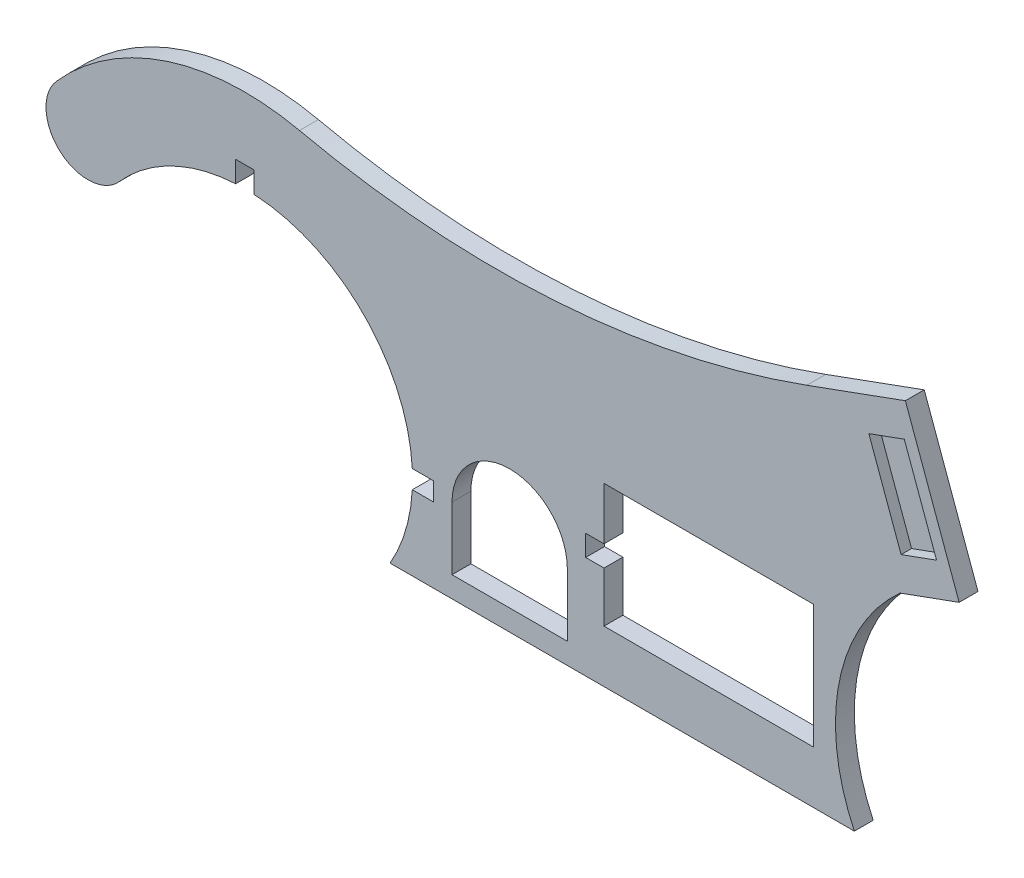
ISO-10303-21;
HEADER;
FILE_DESCRIPTION(('STEP AP214'),'2;1');
FILE_NAME('part.step','',(''),(''),'','','');
FILE_SCHEMA(('AUTOMOTIVE_DESIGN { 1 0 10303 214 1 1 1 1 }'));
ENDSEC;
DATA;
#1=APPLICATION_CONTEXT('core data for automotive mechanical design processes');
#2=APPLICATION_PROTOCOL_DEFINITION('international standard','automotive_design',2000,#1);
#3=PRODUCT_CONTEXT('',#1,'mechanical');
#4=PRODUCT('Part','Part','',(#3));
#5=PRODUCT_RELATED_PRODUCT_CATEGORY('part','',(#4));
#6=PRODUCT_DEFINITION_FORMATION('','',#4);
#7=PRODUCT_DEFINITION_CONTEXT('part definition',#1,'design');
#8=PRODUCT_DEFINITION('design','',#6,#7);
#9=PRODUCT_DEFINITION_SHAPE('','',#8);
#10=(LENGTH_UNIT() NAMED_UNIT(*) SI_UNIT(.MILLI.,.METRE.));
#11=(NAMED_UNIT(*) PLANE_ANGLE_UNIT() SI_UNIT($,.RADIAN.));
#12=(NAMED_UNIT(*) SI_UNIT($,.STERADIAN.) SOLID_ANGLE_UNIT());
#13=UNCERTAINTY_MEASURE_WITH_UNIT(LENGTH_MEASURE(1.E-05),#10,'distance_accuracy_value','');
#14=(GEOMETRIC_REPRESENTATION_CONTEXT(3) GLOBAL_UNCERTAINTY_ASSIGNED_CONTEXT((#13)) GLOBAL_UNIT_ASSIGNED_CONTEXT((#10,
#11,#12)) REPRESENTATION_CONTEXT('',''));
#15=CARTESIAN_POINT('',(0.,0.,0.));
#16=DIRECTION('',(0.,0.,1.));
#17=DIRECTION('',(1.,0.,0.));
#18=AXIS2_PLACEMENT_3D('',#15,#16,#17);
#19=CARTESIAN_POINT('',(-630.167151995381,-300.,18.));
#20=DIRECTION('',(0.,0.,-1.));
#21=DIRECTION('',(-1.,0.,0.));
#22=AXIS2_PLACEMENT_3D('',#19,#20,#21);
#23=CYLINDRICAL_SURFACE('',#22,160.);
#24=CARTESIAN_POINT('',(-630.167151995381,-300.,18.));
#25=DIRECTION('',(0.,0.,-1.));
#26=DIRECTION('',(1.,0.,0.));
#27=AXIS2_PLACEMENT_3D('',#24,#25,#26);
#28=CIRCLE('',#27,160.);
#29=CARTESIAN_POINT('',(-621.417151995381,-140.239436968944,18.));
#30=VERTEX_POINT('',#29);
#31=CARTESIAN_POINT('',(-470.406588964325,-291.25,18.));
#32=VERTEX_POINT('',#31);
#33=EDGE_CURVE('E457',#30,#32,#28,.T.);
#34=ORIENTED_EDGE('',*,*,#33,.F.);
#35=DIRECTION('',(0.,0.,-1.));
#36=VECTOR('',#35,1.);
#37=CARTESIAN_POINT('',(-621.417151995381,-140.239436968944,18.));
#38=LINE('',#37,#36);
#39=CARTESIAN_POINT('',(-621.417151995381,-140.239436968944,0.));
#40=VERTEX_POINT('',#39);
#41=EDGE_CURVE('E339',#30,#40,#38,.T.);
#42=ORIENTED_EDGE('',*,*,#41,.T.);
#43=CARTESIAN_POINT('',(-630.167151995381,-300.,0.));
#44=DIRECTION('',(0.,0.,-1.));
#45=DIRECTION('',(1.,0.,0.));
#46=AXIS2_PLACEMENT_3D('',#43,#44,#45);
#47=CIRCLE('',#46,160.);
#48=CARTESIAN_POINT('',(-470.406588964325,-291.25,0.));
#49=VERTEX_POINT('',#48);
#50=EDGE_CURVE('E271',#40,#49,#47,.T.);
#51=ORIENTED_EDGE('',*,*,#50,.T.);
#52=DIRECTION('',(0.,0.,-1.));
#53=VECTOR('',#52,1.);
#54=CARTESIAN_POINT('',(-470.406588964325,-291.25,18.));
#55=LINE('',#54,#53);
#56=EDGE_CURVE('E58',#49,#32,#55,.F.);
#57=ORIENTED_EDGE('',*,*,#56,.T.);
#58=EDGE_LOOP('',(#34,#42,#51,#57));
#59=FACE_BOUND('',#58,.T.);
#60=ADVANCED_FACE('F35',(#59),#23,.F.);
#61=CARTESIAN_POINT('',(-470.406588964325,-308.75,18.));
#62=VERTEX_POINT('',#61);
#63=CARTESIAN_POINT('',(-491.603087389871,-380.,18.));
#64=VERTEX_POINT('',#63);
#65=EDGE_CURVE('E335',#62,#64,#28,.T.);
#66=ORIENTED_EDGE('',*,*,#65,.F.);
#67=DIRECTION('',(0.,0.,-1.));
#68=VECTOR('',#67,1.);
#69=CARTESIAN_POINT('',(-470.406588964325,-308.75,18.));
#70=LINE('',#69,#68);
#71=CARTESIAN_POINT('',(-470.406588964325,-308.75,0.));
#72=VERTEX_POINT('',#71);
#73=EDGE_CURVE('E327',#62,#72,#70,.T.);
#74=ORIENTED_EDGE('',*,*,#73,.T.);
#75=CARTESIAN_POINT('',(-491.603087389871,-380.,0.));
#76=VERTEX_POINT('',#75);
#77=EDGE_CURVE('E276',#72,#76,#47,.T.);
#78=ORIENTED_EDGE('',*,*,#77,.T.);
#79=DIRECTION('',(0.,0.,-1.));
#80=VECTOR('',#79,1.);
#81=CARTESIAN_POINT('',(-491.603087389871,-380.,18.));
#82=LINE('',#81,#80);
#83=EDGE_CURVE('E305',#64,#76,#82,.T.);
#84=ORIENTED_EDGE('',*,*,#83,.F.);
#85=EDGE_LOOP('',(#66,#74,#78,#84));
#86=FACE_BOUND('',#85,.T.);
#87=ADVANCED_FACE('F333',(#86),#23,.F.);
#88=CARTESIAN_POINT('',(-287.508312236059,-330.,0.));
#89=DIRECTION('',(-1.,0.,0.));
#90=DIRECTION('',(0.,0.,1.));
#91=AXIS2_PLACEMENT_3D('',#88,#89,#90);
#92=PLANE('',#91);
#93=DIRECTION('',(0.,-1.,0.));
#94=VECTOR('',#93,1.);
#95=CARTESIAN_POINT('',(-287.508312236059,-330.,18.));
#96=LINE('',#95,#94);
#97=CARTESIAN_POINT('',(-287.508312236059,-212.,18.));
#98=VERTEX_POINT('',#97);
#99=CARTESIAN_POINT('',(-287.508312236059,-262.,18.));
#100=VERTEX_POINT('',#99);
#101=EDGE_CURVE('E400',#98,#100,#96,.T.);
#102=ORIENTED_EDGE('',*,*,#101,.T.);
#103=DIRECTION('',(0.,0.,1.));
#104=VECTOR('',#103,1.);
#105=CARTESIAN_POINT('',(-287.508312236059,-262.,0.));
#106=LINE('',#105,#104);
#107=CARTESIAN_POINT('',(-287.508312236059,-262.,0.));
#108=VERTEX_POINT('',#107);
#109=EDGE_CURVE('E519',#108,#100,#106,.T.);
#110=ORIENTED_EDGE('',*,*,#109,.F.);
#111=DIRECTION('',(0.,-1.,0.));
#112=VECTOR('',#111,1.);
#113=CARTESIAN_POINT('',(-287.508312236059,-330.,0.));
#114=LINE('',#113,#112);
#115=CARTESIAN_POINT('',(-287.508312236059,-212.,0.));
#116=VERTEX_POINT('',#115);
#117=EDGE_CURVE('E386',#116,#108,#114,.T.);
#118=ORIENTED_EDGE('',*,*,#117,.F.);
#119=DIRECTION('',(0.,0.,1.));
#120=VECTOR('',#119,1.);
#121=CARTESIAN_POINT('',(-287.508312236059,-212.,0.));
#122=LINE('',#121,#120);
#123=EDGE_CURVE('E411',#116,#98,#122,.T.);
#124=ORIENTED_EDGE('',*,*,#123,.T.);
#125=EDGE_LOOP('',(#102,#110,#118,#124));
#126=FACE_BOUND('',#125,.T.);
#127=ADVANCED_FACE('F551',(#126),#92,.F.);
#128=CARTESIAN_POINT('',(0.,0.,18.));
#129=DIRECTION('',(0.342020143325666,-0.939692620785909,0.));
#130=DIRECTION('',(0.93969262078591,0.342020143325666,0.));
#131=AXIS2_PLACEMENT_3D('',#128,#129,#130);
#132=PLANE('',#131);
#133=DIRECTION('',(-0.939692620785909,-0.342020143325666,0.));
#134=VECTOR('',#133,1.);
#135=CARTESIAN_POINT('',(0.,0.,0.));
#136=LINE('',#135,#134);
#137=CARTESIAN_POINT('',(0.,0.,0.));
#138=VERTEX_POINT('',#137);
#139=CARTESIAN_POINT('',(-93.9692620785908,-34.2020143325664,0.));
#140=VERTEX_POINT('',#139);
#141=EDGE_CURVE('E407',#138,#140,#136,.T.);
#142=ORIENTED_EDGE('',*,*,#141,.T.);
#143=DIRECTION('',(0.,0.,-1.));
#144=VECTOR('',#143,1.);
#145=CARTESIAN_POINT('',(-93.9692620785908,-34.2020143325664,18.));
#146=LINE('',#145,#144);
#147=CARTESIAN_POINT('',(-93.9692620785908,-34.2020143325664,18.));
#148=VERTEX_POINT('',#147);
#149=EDGE_CURVE('E317',#148,#140,#146,.T.);
#150=ORIENTED_EDGE('',*,*,#149,.F.);
#151=DIRECTION('',(-0.939692620785909,-0.342020143325666,0.));
#152=VECTOR('',#151,1.);
#153=CARTESIAN_POINT('',(0.,0.,18.));
#154=LINE('',#153,#152);
#155=CARTESIAN_POINT('',(0.,0.,18.));
#156=VERTEX_POINT('',#155);
#157=EDGE_CURVE('E291',#156,#148,#154,.T.);
#158=ORIENTED_EDGE('',*,*,#157,.F.);
#159=DIRECTION('',(0.,0.,-1.));
#160=VECTOR('',#159,1.);
#161=CARTESIAN_POINT('',(0.,0.,18.));
#162=LINE('',#161,#160);
#163=EDGE_CURVE('E292',#156,#138,#162,.T.);
#164=ORIENTED_EDGE('',*,*,#163,.T.);
#165=EDGE_LOOP('',(#142,#150,#158,#164));
#166=FACE_BOUND('',#165,.T.);
#167=ADVANCED_FACE('F37',(#166),#132,.F.);
#168=CARTESIAN_POINT('',(-390.004378585109,779.147783634716,18.));
#169=DIRECTION('',(0.,0.,-1.));
#170=DIRECTION('',(-1.,0.,0.));
#171=AXIS2_PLACEMENT_3D('',#168,#169,#170);
#172=CYLINDRICAL_SURFACE('',#171,865.548776244555);
#173=CARTESIAN_POINT('',(-390.004378585109,779.147783634716,0.));
#174=DIRECTION('',(0.,0.,-1.));
#175=DIRECTION('',(1.,0.,0.));
#176=AXIS2_PLACEMENT_3D('',#173,#174,#175);
#177=CIRCLE('',#176,865.548776244555);
#178=CARTESIAN_POINT('',(-578.030994046512,-65.7313059021104,0.));
#179=VERTEX_POINT('',#178);
#180=EDGE_CURVE('E466',#140,#179,#177,.T.);
#181=ORIENTED_EDGE('',*,*,#180,.T.);
#182=DIRECTION('',(0.,0.,-1.));
#183=VECTOR('',#182,1.);
#184=CARTESIAN_POINT('',(-578.030994046512,-65.7313059021104,18.));
#185=LINE('',#184,#183);
#186=CARTESIAN_POINT('',(-578.030994046512,-65.7313059021104,18.));
#187=VERTEX_POINT('',#186);
#188=EDGE_CURVE('E314',#187,#179,#185,.T.);
#189=ORIENTED_EDGE('',*,*,#188,.F.);
#190=CARTESIAN_POINT('',(-390.004378585109,779.147783634716,18.));
#191=DIRECTION('',(0.,0.,-1.));
#192=DIRECTION('',(1.,0.,0.));
#193=AXIS2_PLACEMENT_3D('',#190,#191,#192);
#194=CIRCLE('',#193,865.548776244555);
#195=EDGE_CURVE('E447',#148,#187,#194,.T.);
#196=ORIENTED_EDGE('',*,*,#195,.F.);
#197=ORIENTED_EDGE('',*,*,#149,.T.);
#198=EDGE_LOOP('',(#181,#189,#196,#197));
#199=FACE_BOUND('',#198,.T.);
#200=ADVANCED_FACE('F593',(#199),#172,.F.);
#201=CARTESIAN_POINT('',(-630.167151995381,-300.,18.));
#202=DIRECTION('',(0.,0.,-1.));
#203=DIRECTION('',(-1.,0.,0.));
#204=AXIS2_PLACEMENT_3D('',#201,#202,#203);
#205=CYLINDRICAL_SURFACE('',#204,240.);
#206=CARTESIAN_POINT('',(-630.167151995381,-300.,0.));
#207=DIRECTION('',(0.,0.,1.));
#208=DIRECTION('',(-1.,0.,0.));
#209=AXIS2_PLACEMENT_3D('',#206,#207,#208);
#210=CIRCLE('',#209,240.);
#211=CARTESIAN_POINT('',(-809.821657990136,-140.864025199264,0.));
#212=VERTEX_POINT('',#211);
#213=EDGE_CURVE('E467',#179,#212,#210,.T.);
#214=ORIENTED_EDGE('',*,*,#213,.T.);
#215=DIRECTION('',(0.,0.,-1.));
#216=VECTOR('',#215,1.);
#217=CARTESIAN_POINT('',(-809.821657990136,-140.864025199264,18.));
#218=LINE('',#217,#216);
#219=CARTESIAN_POINT('',(-809.821657990136,-140.864025199264,18.));
#220=VERTEX_POINT('',#219);
#221=EDGE_CURVE('E311',#220,#212,#218,.T.);
#222=ORIENTED_EDGE('',*,*,#221,.F.);
#223=CARTESIAN_POINT('',(-630.167151995381,-300.,18.));
#224=DIRECTION('',(0.,0.,1.));
#225=DIRECTION('',(-1.,0.,0.));
#226=AXIS2_PLACEMENT_3D('',#223,#224,#225);
#227=CIRCLE('',#226,240.);
#228=EDGE_CURVE('E449',#187,#220,#227,.T.);
#229=ORIENTED_EDGE('',*,*,#228,.F.);
#230=ORIENTED_EDGE('',*,*,#188,.T.);
#231=EDGE_LOOP('',(#214,#222,#229,#230));
#232=FACE_BOUND('',#231,.T.);
#233=ADVANCED_FACE('F589',(#232),#205,.T.);
#234=CARTESIAN_POINT('',(-779.879240324344,-167.386687666053,18.));
#235=DIRECTION('',(0.,0.,-1.));
#236=DIRECTION('',(-1.,0.,0.));
#237=AXIS2_PLACEMENT_3D('',#234,#235,#236);
#238=CYLINDRICAL_SURFACE('',#237,40.);
#239=CARTESIAN_POINT('',(-779.879240324344,-167.386687666053,0.));
#240=DIRECTION('',(0.,0.,1.));
#241=DIRECTION('',(-1.,0.,0.));
#242=AXIS2_PLACEMENT_3D('',#239,#240,#241);
#243=CIRCLE('',#242,40.);
#244=CARTESIAN_POINT('',(-749.936822658551,-193.909350132843,0.));
#245=VERTEX_POINT('',#244);
#246=EDGE_CURVE('E280',#212,#245,#243,.T.);
#247=ORIENTED_EDGE('',*,*,#246,.T.);
#248=DIRECTION('',(0.,0.,-1.));
#249=VECTOR('',#248,1.);
#250=CARTESIAN_POINT('',(-749.936822658551,-193.909350132843,18.));
#251=LINE('',#250,#249);
#252=CARTESIAN_POINT('',(-749.936822658551,-193.909350132843,18.));
#253=VERTEX_POINT('',#252);
#254=EDGE_CURVE('E308',#253,#245,#251,.T.);
#255=ORIENTED_EDGE('',*,*,#254,.F.);
#256=CARTESIAN_POINT('',(-779.879240324344,-167.386687666053,18.));
#257=DIRECTION('',(0.,0.,1.));
#258=DIRECTION('',(-1.,0.,0.));
#259=AXIS2_PLACEMENT_3D('',#256,#257,#258);
#260=CIRCLE('',#259,40.);
#261=EDGE_CURVE('E451',#220,#253,#260,.T.);
#262=ORIENTED_EDGE('',*,*,#261,.F.);
#263=ORIENTED_EDGE('',*,*,#221,.T.);
#264=EDGE_LOOP('',(#247,#255,#262,#263));
#265=FACE_BOUND('',#264,.T.);
#266=ADVANCED_FACE('F474',(#265),#238,.T.);
#267=CARTESIAN_POINT('',(-638.917151995381,-140.239436968944,0.));
#268=VERTEX_POINT('',#267);
#269=EDGE_CURVE('E275',#245,#268,#47,.T.);
#270=ORIENTED_EDGE('',*,*,#269,.T.);
#271=DIRECTION('',(0.,0.,-1.));
#272=VECTOR('',#271,1.);
#273=CARTESIAN_POINT('',(-638.917151995381,-140.239436968944,18.));
#274=LINE('',#273,#272);
#275=CARTESIAN_POINT('',(-638.917151995381,-140.239436968944,18.));
#276=VERTEX_POINT('',#275);
#277=EDGE_CURVE('E336',#268,#276,#274,.F.);
#278=ORIENTED_EDGE('',*,*,#277,.T.);
#279=EDGE_CURVE('E453',#253,#276,#28,.T.);
#280=ORIENTED_EDGE('',*,*,#279,.F.);
#281=ORIENTED_EDGE('',*,*,#254,.T.);
#282=EDGE_LOOP('',(#270,#278,#280,#281));
#283=FACE_BOUND('',#282,.T.);
#284=ADVANCED_FACE('F479',(#283),#23,.F.);
#285=CARTESIAN_POINT('',(-491.603087389871,-380.,18.));
#286=DIRECTION('',(0.,1.,0.));
#287=DIRECTION('',(0.,0.,1.));
#288=AXIS2_PLACEMENT_3D('',#285,#286,#287);
#289=PLANE('',#288);
#290=DIRECTION('',(1.,0.,0.));
#291=VECTOR('',#290,1.);
#292=CARTESIAN_POINT('',(-491.603087389871,-380.,0.));
#293=LINE('',#292,#291);
#294=CARTESIAN_POINT('',(-48.6664138194838,-380.,0.));
#295=VERTEX_POINT('',#294);
#296=EDGE_CURVE('E279',#76,#295,#293,.T.);
#297=ORIENTED_EDGE('',*,*,#296,.T.);
#298=DIRECTION('',(0.,0.,-1.));
#299=VECTOR('',#298,1.);
#300=CARTESIAN_POINT('',(-48.6664138194838,-380.,18.));
#301=LINE('',#300,#299);
#302=CARTESIAN_POINT('',(-48.6664138194838,-380.,18.));
#303=VERTEX_POINT('',#302);
#304=EDGE_CURVE('E302',#303,#295,#301,.T.);
#305=ORIENTED_EDGE('',*,*,#304,.F.);
#306=DIRECTION('',(1.,0.,0.));
#307=VECTOR('',#306,1.);
#308=CARTESIAN_POINT('',(-491.603087389871,-380.,18.));
#309=LINE('',#308,#307);
#310=EDGE_CURVE('E456',#64,#303,#309,.T.);
#311=ORIENTED_EDGE('',*,*,#310,.F.);
#312=ORIENTED_EDGE('',*,*,#83,.T.);
#313=EDGE_LOOP('',(#297,#305,#311,#312));
#314=FACE_BOUND('',#313,.T.);
#315=ADVANCED_FACE('F582',(#314),#289,.F.);
#316=CARTESIAN_POINT('',(119.832848004619,-300.,18.));
#317=DIRECTION('',(0.,0.,-1.));
#318=DIRECTION('',(-1.,0.,0.));
#319=AXIS2_PLACEMENT_3D('',#316,#317,#318);
#320=CYLINDRICAL_SURFACE('',#319,186.52614088987);
#321=CARTESIAN_POINT('',(119.832848004619,-300.,0.));
#322=DIRECTION('',(0.,0.,-1.));
#323=DIRECTION('',(-1.,0.,0.));
#324=AXIS2_PLACEMENT_3D('',#321,#322,#323);
#325=CIRCLE('',#324,186.52614088987);
#326=CARTESIAN_POINT('',(-5.07853574830464,-161.475101717426,0.));
#327=VERTEX_POINT('',#326);
#328=EDGE_CURVE('E285',#295,#327,#325,.T.);
#329=ORIENTED_EDGE('',*,*,#328,.T.);
#330=DIRECTION('',(0.,0.,-1.));
#331=VECTOR('',#330,1.);
#332=CARTESIAN_POINT('',(-5.07853574830464,-161.475101717426,18.));
#333=LINE('',#332,#331);
#334=CARTESIAN_POINT('',(-5.07853574830464,-161.475101717426,18.));
#335=VERTEX_POINT('',#334);
#336=EDGE_CURVE('E299',#335,#327,#333,.T.);
#337=ORIENTED_EDGE('',*,*,#336,.F.);
#338=CARTESIAN_POINT('',(119.832848004619,-300.,18.));
#339=DIRECTION('',(0.,0.,-1.));
#340=DIRECTION('',(-1.,0.,0.));
#341=AXIS2_PLACEMENT_3D('',#338,#339,#340);
#342=CIRCLE('',#341,186.52614088987);
#343=EDGE_CURVE('E459',#303,#335,#342,.T.);
#344=ORIENTED_EDGE('',*,*,#343,.F.);
#345=ORIENTED_EDGE('',*,*,#304,.T.);
#346=EDGE_LOOP('',(#329,#337,#344,#345));
#347=FACE_BOUND('',#346,.T.);
#348=ADVANCED_FACE('F587',(#347),#320,.F.);
#349=CARTESIAN_POINT('',(51.3030214988499,-140.953893117886,18.));
#350=DIRECTION('',(-0.342020143325666,0.939692620785909,0.));
#351=DIRECTION('',(-0.939692620785909,-0.342020143325666,0.));
#352=AXIS2_PLACEMENT_3D('',#349,#350,#351);
#353=PLANE('',#352);
#354=DIRECTION('',(0.939692620785909,0.342020143325666,0.));
#355=VECTOR('',#354,1.);
#356=CARTESIAN_POINT('',(51.3030214988499,-140.953893117886,0.));
#357=LINE('',#356,#355);
#358=CARTESIAN_POINT('',(51.3030214988499,-140.953893117886,0.));
#359=VERTEX_POINT('',#358);
#360=EDGE_CURVE('E287',#327,#359,#357,.T.);
#361=ORIENTED_EDGE('',*,*,#360,.T.);
#362=DIRECTION('',(0.,0.,-1.));
#363=VECTOR('',#362,1.);
#364=CARTESIAN_POINT('',(51.3030214988499,-140.953893117886,18.));
#365=LINE('',#364,#363);
#366=CARTESIAN_POINT('',(51.3030214988499,-140.953893117886,18.));
#367=VERTEX_POINT('',#366);
#368=EDGE_CURVE('E295',#367,#359,#365,.T.);
#369=ORIENTED_EDGE('',*,*,#368,.F.);
#370=DIRECTION('',(0.939692620785909,0.342020143325666,0.));
#371=VECTOR('',#370,1.);
#372=CARTESIAN_POINT('',(51.3030214988499,-140.953893117886,18.));
#373=LINE('',#372,#371);
#374=EDGE_CURVE('E461',#335,#367,#373,.T.);
#375=ORIENTED_EDGE('',*,*,#374,.F.);
#376=ORIENTED_EDGE('',*,*,#336,.T.);
#377=EDGE_LOOP('',(#361,#369,#375,#376));
#378=FACE_BOUND('',#377,.T.);
#379=ADVANCED_FACE('F617',(#378),#353,.F.);
#380=CARTESIAN_POINT('',(0.,0.,18.));
#381=DIRECTION('',(-0.939692620785909,-0.342020143325666,0.));
#382=DIRECTION('',(0.342020143325666,-0.93969262078591,0.));
#383=AXIS2_PLACEMENT_3D('',#380,#381,#382);
#384=PLANE('',#383);
#385=DIRECTION('',(-0.342020143325666,0.939692620785909,0.));
#386=VECTOR('',#385,1.);
#387=CARTESIAN_POINT('',(0.,0.,0.));
#388=LINE('',#387,#386);
#389=EDGE_CURVE('E289',#359,#138,#388,.T.);
#390=ORIENTED_EDGE('',*,*,#389,.T.);
#391=ORIENTED_EDGE('',*,*,#163,.F.);
#392=DIRECTION('',(-0.342020143325666,0.939692620785909,0.));
#393=VECTOR('',#392,1.);
#394=CARTESIAN_POINT('',(0.,0.,18.));
#395=LINE('',#394,#393);
#396=EDGE_CURVE('E296',#367,#156,#395,.T.);
#397=ORIENTED_EDGE('',*,*,#396,.F.);
#398=ORIENTED_EDGE('',*,*,#368,.T.);
#399=EDGE_LOOP('',(#390,#391,#397,#398));
#400=FACE_BOUND('',#399,.T.);
#401=ADVANCED_FACE('F613',(#400),#384,.F.);
#402=CARTESIAN_POINT('',(-390.004378585109,779.147783634716,18.));
#403=DIRECTION('',(0.,0.,1.));
#404=DIRECTION('',(1.,0.,0.));
#405=AXIS2_PLACEMENT_3D('',#402,#403,#404);
#406=PLANE('',#405);
#407=DIRECTION('',(0.,1.,0.));
#408=VECTOR('',#407,1.);
#409=CARTESIAN_POINT('',(-621.417151995381,-160.,18.));
#410=LINE('',#409,#408);
#411=CARTESIAN_POINT('',(-621.417151995381,-120.,18.));
#412=VERTEX_POINT('',#411);
#413=EDGE_CURVE('E255',#30,#412,#410,.T.);
#414=ORIENTED_EDGE('',*,*,#413,.F.);
#415=ORIENTED_EDGE('',*,*,#33,.T.);
#416=DIRECTION('',(-1.,0.,0.));
#417=VECTOR('',#416,1.);
#418=CARTESIAN_POINT('',(-490.167151995381,-291.25,18.));
#419=LINE('',#418,#417);
#420=CARTESIAN_POINT('',(-450.167151995381,-291.25,18.));
#421=VERTEX_POINT('',#420);
#422=EDGE_CURVE('E494',#421,#32,#419,.T.);
#423=ORIENTED_EDGE('',*,*,#422,.F.);
#424=DIRECTION('',(0.,1.,0.));
#425=VECTOR('',#424,1.);
#426=CARTESIAN_POINT('',(-450.167151995381,-308.75,18.));
#427=LINE('',#426,#425);
#428=CARTESIAN_POINT('',(-450.167151995381,-308.75,18.));
#429=VERTEX_POINT('',#428);
#430=EDGE_CURVE('E491',#429,#421,#427,.T.);
#431=ORIENTED_EDGE('',*,*,#430,.F.);
#432=DIRECTION('',(1.,0.,0.));
#433=VECTOR('',#432,1.);
#434=CARTESIAN_POINT('',(-490.167151995381,-308.75,18.));
#435=LINE('',#434,#433);
#436=EDGE_CURVE('E488',#62,#429,#435,.T.);
#437=ORIENTED_EDGE('',*,*,#436,.F.);
#438=ORIENTED_EDGE('',*,*,#65,.T.);
#439=ORIENTED_EDGE('',*,*,#310,.T.);
#440=ORIENTED_EDGE('',*,*,#343,.T.);
#441=ORIENTED_EDGE('',*,*,#374,.T.);
#442=ORIENTED_EDGE('',*,*,#396,.T.);
#443=ORIENTED_EDGE('',*,*,#157,.T.);
#444=ORIENTED_EDGE('',*,*,#195,.T.);
#445=ORIENTED_EDGE('',*,*,#228,.T.);
#446=ORIENTED_EDGE('',*,*,#261,.T.);
#447=ORIENTED_EDGE('',*,*,#279,.T.);
#448=DIRECTION('',(0.,-1.,0.));
#449=VECTOR('',#448,1.);
#450=CARTESIAN_POINT('',(-638.917151995381,-160.,18.));
#451=LINE('',#450,#449);
#452=CARTESIAN_POINT('',(-638.917151995381,-120.,18.));
#453=VERTEX_POINT('',#452);
#454=EDGE_CURVE('E265',#453,#276,#451,.T.);
#455=ORIENTED_EDGE('',*,*,#454,.F.);
#456=DIRECTION('',(-1.,0.,0.));
#457=VECTOR('',#456,1.);
#458=CARTESIAN_POINT('',(-638.917151995381,-120.,18.));
#459=LINE('',#458,#457);
#460=EDGE_CURVE('E483',#412,#453,#459,.T.);
#461=ORIENTED_EDGE('',*,*,#460,.F.);
#462=EDGE_LOOP('',(#414,#415,#423,#431,#437,#438,#439,#440,#441,#442,#443,#444,#445,#446,#447,
#455,#461));
#463=FACE_BOUND('',#462,.T.);
#464=DIRECTION('',(-1.,0.,0.));
#465=VECTOR('',#464,1.);
#466=CARTESIAN_POINT('',(-287.508312236059,-262.,18.));
#467=LINE('',#466,#465);
#468=CARTESIAN_POINT('',(-305.008312236059,-262.,18.));
#469=VERTEX_POINT('',#468);
#470=EDGE_CURVE('E504',#100,#469,#467,.T.);
#471=ORIENTED_EDGE('',*,*,#470,.F.);
#472=ORIENTED_EDGE('',*,*,#101,.F.);
#473=DIRECTION('',(-1.,0.,0.));
#474=VECTOR('',#473,1.);
#475=CARTESIAN_POINT('',(-287.508312236059,-212.,18.));
#476=LINE('',#475,#474);
#477=CARTESIAN_POINT('',(-87.5083122360586,-212.,18.));
#478=VERTEX_POINT('',#477);
#479=EDGE_CURVE('E395',#478,#98,#476,.T.);
#480=ORIENTED_EDGE('',*,*,#479,.F.);
#481=DIRECTION('',(0.,1.,0.));
#482=VECTOR('',#481,1.);
#483=CARTESIAN_POINT('',(-87.5083122360586,-330.,18.));
#484=LINE('',#483,#482);
#485=CARTESIAN_POINT('',(-87.5083122360586,-330.,18.));
#486=VERTEX_POINT('',#485);
#487=EDGE_CURVE('E393',#486,#478,#484,.T.);
#488=ORIENTED_EDGE('',*,*,#487,.F.);
#489=DIRECTION('',(1.,0.,0.));
#490=VECTOR('',#489,1.);
#491=CARTESIAN_POINT('',(-287.508312236059,-330.,18.));
#492=LINE('',#491,#490);
#493=CARTESIAN_POINT('',(-287.508312236059,-330.,18.));
#494=VERTEX_POINT('',#493);
#495=EDGE_CURVE('E382',#494,#486,#492,.T.);
#496=ORIENTED_EDGE('',*,*,#495,.F.);
#497=CARTESIAN_POINT('',(-287.508312236059,-282.,18.));
#498=VERTEX_POINT('',#497);
#499=EDGE_CURVE('E399',#498,#494,#96,.T.);
#500=ORIENTED_EDGE('',*,*,#499,.F.);
#501=DIRECTION('',(1.,0.,0.));
#502=VECTOR('',#501,1.);
#503=CARTESIAN_POINT('',(-287.508312236059,-282.,18.));
#504=LINE('',#503,#502);
#505=CARTESIAN_POINT('',(-305.008312236059,-282.,18.));
#506=VERTEX_POINT('',#505);
#507=EDGE_CURVE('E514',#506,#498,#504,.T.);
#508=ORIENTED_EDGE('',*,*,#507,.F.);
#509=DIRECTION('',(0.,-1.,0.));
#510=VECTOR('',#509,1.);
#511=CARTESIAN_POINT('',(-305.008312236059,-282.,18.));
#512=LINE('',#511,#510);
#513=EDGE_CURVE('E511',#469,#506,#512,.T.);
#514=ORIENTED_EDGE('',*,*,#513,.F.);
#515=EDGE_LOOP('',(#471,#472,#480,#488,#496,#500,#508,#514));
#516=FACE_BOUND('',#515,.T.);
#517=DIRECTION('',(-0.939692620785909,-0.342020143325666,0.));
#518=VECTOR('',#517,1.);
#519=CARTESIAN_POINT('',(-1.01570714966093,-32.2950203434853,18.));
#520=LINE('',#519,#518);
#521=CARTESIAN_POINT('',(-1.01570714966093,-32.2950203434853,18.));
#522=VERTEX_POINT('',#521);
#523=CARTESIAN_POINT('',(-34.8446414979536,-44.6077455032092,18.));
#524=VERTEX_POINT('',#523);
#525=EDGE_CURVE('E345',#522,#524,#520,.T.);
#526=ORIENTED_EDGE('',*,*,#525,.F.);
#527=DIRECTION('',(-0.342020143325666,0.939692620785909,0.));
#528=VECTOR('',#527,1.);
#529=CARTESIAN_POINT('',(-1.01570714966093,-32.2950203434853,18.));
#530=LINE('',#529,#528);
#531=CARTESIAN_POINT('',(29.766105749649,-116.867356214217,18.));
#532=VERTEX_POINT('',#531);
#533=EDGE_CURVE('E350',#532,#522,#530,.T.);
#534=ORIENTED_EDGE('',*,*,#533,.F.);
#535=DIRECTION('',(0.939692620785909,0.342020143325666,0.));
#536=VECTOR('',#535,1.);
#537=CARTESIAN_POINT('',(29.766105749649,-116.867356214217,18.));
#538=LINE('',#537,#536);
#539=CARTESIAN_POINT('',(-4.06282859864369,-129.180081373941,18.));
#540=VERTEX_POINT('',#539);
#541=EDGE_CURVE('E364',#540,#532,#538,.T.);
#542=ORIENTED_EDGE('',*,*,#541,.F.);
#543=DIRECTION('',(0.342020143325666,-0.939692620785909,0.));
#544=VECTOR('',#543,1.);
#545=CARTESIAN_POINT('',(-34.8446414979536,-44.6077455032092,18.));
#546=LINE('',#545,#544);
#547=EDGE_CURVE('E361',#524,#540,#546,.T.);
#548=ORIENTED_EDGE('',*,*,#547,.F.);
#549=EDGE_LOOP('',(#526,#534,#542,#548));
#550=FACE_BOUND('',#549,.T.);
#551=CARTESIAN_POINT('',(-377.508312236059,-300.,18.));
#552=DIRECTION('',(0.,0.,1.));
#553=DIRECTION('',(-1.,0.,0.));
#554=AXIS2_PLACEMENT_3D('',#551,#552,#553);
#555=CIRCLE('',#554,55.);
#556=CARTESIAN_POINT('',(-322.508312236059,-300.,18.));
#557=VERTEX_POINT('',#556);
#558=CARTESIAN_POINT('',(-432.508312236059,-300.,18.));
#559=VERTEX_POINT('',#558);
#560=EDGE_CURVE('E371',#557,#559,#555,.T.);
#561=ORIENTED_EDGE('',*,*,#560,.F.);
#562=DIRECTION('',(0.,1.,0.));
#563=VECTOR('',#562,1.);
#564=CARTESIAN_POINT('',(-322.508312236059,-360.,18.));
#565=LINE('',#564,#563);
#566=CARTESIAN_POINT('',(-322.508312236059,-360.,18.));
#567=VERTEX_POINT('',#566);
#568=EDGE_CURVE('E419',#567,#557,#565,.T.);
#569=ORIENTED_EDGE('',*,*,#568,.F.);
#570=DIRECTION('',(1.,0.,0.));
#571=VECTOR('',#570,1.);
#572=CARTESIAN_POINT('',(-322.508312236059,-360.,18.));
#573=LINE('',#572,#571);
#574=CARTESIAN_POINT('',(-432.508312236059,-360.,18.));
#575=VERTEX_POINT('',#574);
#576=EDGE_CURVE('E433',#575,#567,#573,.T.);
#577=ORIENTED_EDGE('',*,*,#576,.F.);
#578=DIRECTION('',(0.,-1.,0.));
#579=VECTOR('',#578,1.);
#580=CARTESIAN_POINT('',(-432.508312236059,-360.,18.));
#581=LINE('',#580,#579);
#582=EDGE_CURVE('E430',#559,#575,#581,.T.);
#583=ORIENTED_EDGE('',*,*,#582,.F.);
#584=EDGE_LOOP('',(#561,#569,#577,#583));
#585=FACE_BOUND('',#584,.T.);
#586=ADVANCED_FACE('F534',(#463,#516,#550,#585),#406,.T.);
#587=CARTESIAN_POINT('',(-390.004378585109,779.147783634716,0.));
#588=DIRECTION('',(0.,0.,1.));
#589=DIRECTION('',(1.,0.,0.));
#590=AXIS2_PLACEMENT_3D('',#587,#588,#589);
#591=PLANE('',#590);
#592=ORIENTED_EDGE('',*,*,#50,.F.);
#593=DIRECTION('',(0.,1.,0.));
#594=VECTOR('',#593,1.);
#595=CARTESIAN_POINT('',(-621.417151995381,779.147783634716,0.));
#596=LINE('',#595,#594);
#597=CARTESIAN_POINT('',(-621.417151995381,-120.,0.));
#598=VERTEX_POINT('',#597);
#599=EDGE_CURVE('E11',#40,#598,#596,.T.);
#600=ORIENTED_EDGE('',*,*,#599,.T.);
#601=DIRECTION('',(-1.,0.,0.));
#602=VECTOR('',#601,1.);
#603=CARTESIAN_POINT('',(-638.917151995381,-120.,0.));
#604=LINE('',#603,#602);
#605=CARTESIAN_POINT('',(-638.917151995381,-120.,0.));
#606=VERTEX_POINT('',#605);
#607=EDGE_CURVE('E262',#598,#606,#604,.T.);
#608=ORIENTED_EDGE('',*,*,#607,.T.);
#609=DIRECTION('',(0.,-1.,0.));
#610=VECTOR('',#609,1.);
#611=CARTESIAN_POINT('',(-638.917151995381,-160.,0.));
#612=LINE('',#611,#610);
#613=EDGE_CURVE('E50',#606,#268,#612,.T.);
#614=ORIENTED_EDGE('',*,*,#613,.T.);
#615=ORIENTED_EDGE('',*,*,#269,.F.);
#616=ORIENTED_EDGE('',*,*,#246,.F.);
#617=ORIENTED_EDGE('',*,*,#213,.F.);
#618=ORIENTED_EDGE('',*,*,#180,.F.);
#619=ORIENTED_EDGE('',*,*,#141,.F.);
#620=ORIENTED_EDGE('',*,*,#389,.F.);
#621=ORIENTED_EDGE('',*,*,#360,.F.);
#622=ORIENTED_EDGE('',*,*,#328,.F.);
#623=ORIENTED_EDGE('',*,*,#296,.F.);
#624=ORIENTED_EDGE('',*,*,#77,.F.);
#625=DIRECTION('',(1.,0.,0.));
#626=VECTOR('',#625,1.);
#627=CARTESIAN_POINT('',(-390.004378585107,-308.75,0.));
#628=LINE('',#627,#626);
#629=CARTESIAN_POINT('',(-450.167151995381,-308.75,0.));
#630=VERTEX_POINT('',#629);
#631=EDGE_CURVE('E43',#72,#630,#628,.T.);
#632=ORIENTED_EDGE('',*,*,#631,.T.);
#633=DIRECTION('',(0.,1.,0.));
#634=VECTOR('',#633,1.);
#635=CARTESIAN_POINT('',(-450.167151995381,-308.75,0.));
#636=LINE('',#635,#634);
#637=CARTESIAN_POINT('',(-450.167151995381,-291.25,0.));
#638=VERTEX_POINT('',#637);
#639=EDGE_CURVE('E322',#630,#638,#636,.T.);
#640=ORIENTED_EDGE('',*,*,#639,.T.);
#641=DIRECTION('',(-1.,0.,0.));
#642=VECTOR('',#641,1.);
#643=CARTESIAN_POINT('',(-490.167151995381,-291.25,0.));
#644=LINE('',#643,#642);
#645=EDGE_CURVE('E273',#638,#49,#644,.T.);
#646=ORIENTED_EDGE('',*,*,#645,.T.);
#647=EDGE_LOOP('',(#592,#600,#608,#614,#615,#616,#617,#618,#619,#620,#621,#622,#623,#624,#632,
#640,#646));
#648=FACE_BOUND('',#647,.T.);
#649=ORIENTED_EDGE('',*,*,#117,.T.);
#650=DIRECTION('',(-1.,0.,0.));
#651=VECTOR('',#650,1.);
#652=CARTESIAN_POINT('',(-287.508312236059,-262.,0.));
#653=LINE('',#652,#651);
#654=CARTESIAN_POINT('',(-305.008312236059,-262.,0.));
#655=VERTEX_POINT('',#654);
#656=EDGE_CURVE('E507',#108,#655,#653,.T.);
#657=ORIENTED_EDGE('',*,*,#656,.T.);
#658=DIRECTION('',(0.,-1.,0.));
#659=VECTOR('',#658,1.);
#660=CARTESIAN_POINT('',(-305.008312236059,-282.,0.));
#661=LINE('',#660,#659);
#662=CARTESIAN_POINT('',(-305.008312236059,-282.,0.));
#663=VERTEX_POINT('',#662);
#664=EDGE_CURVE('E500',#655,#663,#661,.T.);
#665=ORIENTED_EDGE('',*,*,#664,.T.);
#666=DIRECTION('',(1.,0.,0.));
#667=VECTOR('',#666,1.);
#668=CARTESIAN_POINT('',(-287.508312236059,-282.,0.));
#669=LINE('',#668,#667);
#670=CARTESIAN_POINT('',(-287.508312236059,-282.,0.));
#671=VERTEX_POINT('',#670);
#672=EDGE_CURVE('E503',#663,#671,#669,.T.);
#673=ORIENTED_EDGE('',*,*,#672,.T.);
#674=CARTESIAN_POINT('',(-287.508312236059,-330.,0.));
#675=VERTEX_POINT('',#674);
#676=EDGE_CURVE('E385',#671,#675,#114,.T.);
#677=ORIENTED_EDGE('',*,*,#676,.T.);
#678=DIRECTION('',(1.,0.,0.));
#679=VECTOR('',#678,1.);
#680=CARTESIAN_POINT('',(-287.508312236059,-330.,0.));
#681=LINE('',#680,#679);
#682=CARTESIAN_POINT('',(-87.5083122360586,-330.,0.));
#683=VERTEX_POINT('',#682);
#684=EDGE_CURVE('E389',#675,#683,#681,.T.);
#685=ORIENTED_EDGE('',*,*,#684,.T.);
#686=DIRECTION('',(0.,1.,0.));
#687=VECTOR('',#686,1.);
#688=CARTESIAN_POINT('',(-87.5083122360586,-330.,0.));
#689=LINE('',#688,#687);
#690=CARTESIAN_POINT('',(-87.5083122360586,-212.,0.));
#691=VERTEX_POINT('',#690);
#692=EDGE_CURVE('E378',#683,#691,#689,.T.);
#693=ORIENTED_EDGE('',*,*,#692,.T.);
#694=DIRECTION('',(-1.,0.,0.));
#695=VECTOR('',#694,1.);
#696=CARTESIAN_POINT('',(-287.508312236059,-212.,0.));
#697=LINE('',#696,#695);
#698=EDGE_CURVE('E381',#691,#116,#697,.T.);
#699=ORIENTED_EDGE('',*,*,#698,.T.);
#700=EDGE_LOOP('',(#649,#657,#665,#673,#677,#685,#693,#699));
#701=FACE_BOUND('',#700,.T.);
#702=DIRECTION('',(0.,1.,0.));
#703=VECTOR('',#702,1.);
#704=CARTESIAN_POINT('',(-322.508312236059,-360.,0.));
#705=LINE('',#704,#703);
#706=CARTESIAN_POINT('',(-322.508312236059,-360.,0.));
#707=VERTEX_POINT('',#706);
#708=CARTESIAN_POINT('',(-322.508312236059,-300.,0.));
#709=VERTEX_POINT('',#708);
#710=EDGE_CURVE('E425',#707,#709,#705,.T.);
#711=ORIENTED_EDGE('',*,*,#710,.T.);
#712=CARTESIAN_POINT('',(-377.508312236059,-300.,0.));
#713=DIRECTION('',(0.,0.,1.));
#714=DIRECTION('',(-1.,0.,0.));
#715=AXIS2_PLACEMENT_3D('',#712,#713,#714);
#716=CIRCLE('',#715,55.);
#717=CARTESIAN_POINT('',(-432.508312236059,-300.,0.));
#718=VERTEX_POINT('',#717);
#719=EDGE_CURVE('E415',#709,#718,#716,.T.);
#720=ORIENTED_EDGE('',*,*,#719,.T.);
#721=DIRECTION('',(0.,-1.,0.));
#722=VECTOR('',#721,1.);
#723=CARTESIAN_POINT('',(-432.508312236059,-360.,0.));
#724=LINE('',#723,#722);
#725=CARTESIAN_POINT('',(-432.508312236059,-360.,0.));
#726=VERTEX_POINT('',#725);
#727=EDGE_CURVE('E418',#718,#726,#724,.T.);
#728=ORIENTED_EDGE('',*,*,#727,.T.);
#729=DIRECTION('',(1.,0.,0.));
#730=VECTOR('',#729,1.);
#731=CARTESIAN_POINT('',(-322.508312236059,-360.,0.));
#732=LINE('',#731,#730);
#733=EDGE_CURVE('E422',#726,#707,#732,.T.);
#734=ORIENTED_EDGE('',*,*,#733,.T.);
#735=EDGE_LOOP('',(#711,#720,#728,#734));
#736=FACE_BOUND('',#735,.T.);
#737=ADVANCED_FACE('F268',(#648,#701,#736),#591,.F.);
#738=CARTESIAN_POINT('',(-377.508312236059,-300.,0.));
#739=DIRECTION('',(0.,0.,1.));
#740=DIRECTION('',(1.,0.,0.));
#741=AXIS2_PLACEMENT_3D('',#738,#739,#740);
#742=CYLINDRICAL_SURFACE('',#741,55.);
#743=ORIENTED_EDGE('',*,*,#560,.T.);
#744=DIRECTION('',(0.,0.,1.));
#745=VECTOR('',#744,1.);
#746=CARTESIAN_POINT('',(-432.508312236059,-300.,0.));
#747=LINE('',#746,#745);
#748=EDGE_CURVE('E428',#718,#559,#747,.T.);
#749=ORIENTED_EDGE('',*,*,#748,.F.);
#750=ORIENTED_EDGE('',*,*,#719,.F.);
#751=DIRECTION('',(0.,0.,1.));
#752=VECTOR('',#751,1.);
#753=CARTESIAN_POINT('',(-322.508312236059,-300.,0.));
#754=LINE('',#753,#752);
#755=EDGE_CURVE('E396',#709,#557,#754,.T.);
#756=ORIENTED_EDGE('',*,*,#755,.T.);
#757=EDGE_LOOP('',(#743,#749,#750,#756));
#758=FACE_BOUND('',#757,.T.);
#759=ADVANCED_FACE('F813',(#758),#742,.F.);
#760=CARTESIAN_POINT('',(-322.508312236059,-360.,0.));
#761=DIRECTION('',(1.,0.,0.));
#762=DIRECTION('',(0.,0.,-1.));
#763=AXIS2_PLACEMENT_3D('',#760,#761,#762);
#764=PLANE('',#763);
#765=ORIENTED_EDGE('',*,*,#568,.T.);
#766=ORIENTED_EDGE('',*,*,#755,.F.);
#767=ORIENTED_EDGE('',*,*,#710,.F.);
#768=DIRECTION('',(0.,0.,1.));
#769=VECTOR('',#768,1.);
#770=CARTESIAN_POINT('',(-322.508312236059,-360.,0.));
#771=LINE('',#770,#769);
#772=EDGE_CURVE('E439',#707,#567,#771,.T.);
#773=ORIENTED_EDGE('',*,*,#772,.T.);
#774=EDGE_LOOP('',(#765,#766,#767,#773));
#775=FACE_BOUND('',#774,.T.);
#776=ADVANCED_FACE('F804',(#775),#764,.F.);
#777=CARTESIAN_POINT('',(-322.508312236059,-360.,0.));
#778=DIRECTION('',(0.,-1.,0.));
#779=DIRECTION('',(0.,0.,-1.));
#780=AXIS2_PLACEMENT_3D('',#777,#778,#779);
#781=PLANE('',#780);
#782=ORIENTED_EDGE('',*,*,#576,.T.);
#783=ORIENTED_EDGE('',*,*,#772,.F.);
#784=ORIENTED_EDGE('',*,*,#733,.F.);
#785=DIRECTION('',(0.,0.,1.));
#786=VECTOR('',#785,1.);
#787=CARTESIAN_POINT('',(-432.508312236059,-360.,0.));
#788=LINE('',#787,#786);
#789=EDGE_CURVE('E441',#726,#575,#788,.T.);
#790=ORIENTED_EDGE('',*,*,#789,.T.);
#791=EDGE_LOOP('',(#782,#783,#784,#790));
#792=FACE_BOUND('',#791,.T.);
#793=ADVANCED_FACE('F568',(#792),#781,.F.);
#794=CARTESIAN_POINT('',(-432.508312236059,-360.,0.));
#795=DIRECTION('',(-1.,0.,0.));
#796=DIRECTION('',(0.,0.,1.));
#797=AXIS2_PLACEMENT_3D('',#794,#795,#796);
#798=PLANE('',#797);
#799=ORIENTED_EDGE('',*,*,#582,.T.);
#800=ORIENTED_EDGE('',*,*,#789,.F.);
#801=ORIENTED_EDGE('',*,*,#727,.F.);
#802=ORIENTED_EDGE('',*,*,#748,.T.);
#803=EDGE_LOOP('',(#799,#800,#801,#802));
#804=FACE_BOUND('',#803,.T.);
#805=ADVANCED_FACE('F561',(#804),#798,.F.);
#806=CARTESIAN_POINT('',(-87.5083122360586,-330.,0.));
#807=DIRECTION('',(1.,0.,0.));
#808=DIRECTION('',(0.,0.,-1.));
#809=AXIS2_PLACEMENT_3D('',#806,#807,#808);
#810=PLANE('',#809);
#811=ORIENTED_EDGE('',*,*,#487,.T.);
#812=DIRECTION('',(0.,0.,1.));
#813=VECTOR('',#812,1.);
#814=CARTESIAN_POINT('',(-87.5083122360586,-212.,0.));
#815=LINE('',#814,#813);
#816=EDGE_CURVE('E392',#691,#478,#815,.T.);
#817=ORIENTED_EDGE('',*,*,#816,.F.);
#818=ORIENTED_EDGE('',*,*,#692,.F.);
#819=DIRECTION('',(0.,0.,1.));
#820=VECTOR('',#819,1.);
#821=CARTESIAN_POINT('',(-87.5083122360586,-330.,0.));
#822=LINE('',#821,#820);
#823=EDGE_CURVE('E405',#683,#486,#822,.T.);
#824=ORIENTED_EDGE('',*,*,#823,.T.);
#825=EDGE_LOOP('',(#811,#817,#818,#824));
#826=FACE_BOUND('',#825,.T.);
#827=ADVANCED_FACE('F559',(#826),#810,.F.);
#828=CARTESIAN_POINT('',(-287.508312236059,-330.,0.));
#829=DIRECTION('',(0.,-1.,0.));
#830=DIRECTION('',(0.,0.,-1.));
#831=AXIS2_PLACEMENT_3D('',#828,#829,#830);
#832=PLANE('',#831);
#833=ORIENTED_EDGE('',*,*,#495,.T.);
#834=ORIENTED_EDGE('',*,*,#823,.F.);
#835=ORIENTED_EDGE('',*,*,#684,.F.);
#836=DIRECTION('',(0.,0.,1.));
#837=VECTOR('',#836,1.);
#838=CARTESIAN_POINT('',(-287.508312236059,-330.,0.));
#839=LINE('',#838,#837);
#840=EDGE_CURVE('E408',#675,#494,#839,.T.);
#841=ORIENTED_EDGE('',*,*,#840,.T.);
#842=EDGE_LOOP('',(#833,#834,#835,#841));
#843=FACE_BOUND('',#842,.T.);
#844=ADVANCED_FACE('F544',(#843),#832,.F.);
#845=ORIENTED_EDGE('',*,*,#676,.F.);
#846=DIRECTION('',(0.,0.,1.));
#847=VECTOR('',#846,1.);
#848=CARTESIAN_POINT('',(-287.508312236059,-282.,0.));
#849=LINE('',#848,#847);
#850=EDGE_CURVE('E521',#671,#498,#849,.T.);
#851=ORIENTED_EDGE('',*,*,#850,.T.);
#852=ORIENTED_EDGE('',*,*,#499,.T.);
#853=ORIENTED_EDGE('',*,*,#840,.F.);
#854=EDGE_LOOP('',(#845,#851,#852,#853));
#855=FACE_BOUND('',#854,.T.);
#856=ADVANCED_FACE('F541',(#855),#92,.F.);
#857=CARTESIAN_POINT('',(-287.508312236059,-212.,0.));
#858=DIRECTION('',(0.,1.,0.));
#859=DIRECTION('',(0.,0.,1.));
#860=AXIS2_PLACEMENT_3D('',#857,#858,#859);
#861=PLANE('',#860);
#862=ORIENTED_EDGE('',*,*,#479,.T.);
#863=ORIENTED_EDGE('',*,*,#123,.F.);
#864=ORIENTED_EDGE('',*,*,#698,.F.);
#865=ORIENTED_EDGE('',*,*,#816,.T.);
#866=EDGE_LOOP('',(#862,#863,#864,#865));
#867=FACE_BOUND('',#866,.T.);
#868=ADVANCED_FACE('F556',(#867),#861,.F.);
#869=CARTESIAN_POINT('',(-1.01570714966093,-32.2950203434853,8.));
#870=DIRECTION('',(-0.342020143325666,0.939692620785909,0.));
#871=DIRECTION('',(-0.939692620785909,-0.342020143325666,0.));
#872=AXIS2_PLACEMENT_3D('',#869,#870,#871);
#873=PLANE('',#872);
#874=ORIENTED_EDGE('',*,*,#525,.T.);
#875=DIRECTION('',(0.,0.,1.));
#876=VECTOR('',#875,1.);
#877=CARTESIAN_POINT('',(-34.8446414979536,-44.6077455032092,8.));
#878=LINE('',#877,#876);
#879=CARTESIAN_POINT('',(-34.8446414979536,-44.6077455032092,8.));
#880=VERTEX_POINT('',#879);
#881=EDGE_CURVE('E359',#880,#524,#878,.T.);
#882=ORIENTED_EDGE('',*,*,#881,.F.);
#883=DIRECTION('',(-0.939692620785909,-0.342020143325666,0.));
#884=VECTOR('',#883,1.);
#885=CARTESIAN_POINT('',(-1.01570714966093,-32.2950203434853,8.));
#886=LINE('',#885,#884);
#887=CARTESIAN_POINT('',(-1.01570714966093,-32.2950203434853,8.));
#888=VERTEX_POINT('',#887);
#889=EDGE_CURVE('E346',#888,#880,#886,.T.);
#890=ORIENTED_EDGE('',*,*,#889,.F.);
#891=DIRECTION('',(0.,0.,1.));
#892=VECTOR('',#891,1.);
#893=CARTESIAN_POINT('',(-1.01570714966093,-32.2950203434853,8.));
#894=LINE('',#893,#892);
#895=EDGE_CURVE('E369',#888,#522,#894,.T.);
#896=ORIENTED_EDGE('',*,*,#895,.T.);
#897=EDGE_LOOP('',(#874,#882,#890,#896));
#898=FACE_BOUND('',#897,.T.);
#899=ADVANCED_FACE('F661',(#898),#873,.F.);
#900=CARTESIAN_POINT('',(-1.01570714966093,-32.2950203434853,8.));
#901=DIRECTION('',(0.939692620785909,0.342020143325666,0.));
#902=DIRECTION('',(-0.342020143325666,0.939692620785909,0.));
#903=AXIS2_PLACEMENT_3D('',#900,#901,#902);
#904=PLANE('',#903);
#905=ORIENTED_EDGE('',*,*,#533,.T.);
#906=ORIENTED_EDGE('',*,*,#895,.F.);
#907=DIRECTION('',(-0.342020143325666,0.939692620785909,0.));
#908=VECTOR('',#907,1.);
#909=CARTESIAN_POINT('',(-1.01570714966093,-32.2950203434853,8.));
#910=LINE('',#909,#908);
#911=CARTESIAN_POINT('',(29.766105749649,-116.867356214217,8.));
#912=VERTEX_POINT('',#911);
#913=EDGE_CURVE('E356',#912,#888,#910,.T.);
#914=ORIENTED_EDGE('',*,*,#913,.F.);
#915=DIRECTION('',(0.,0.,1.));
#916=VECTOR('',#915,1.);
#917=CARTESIAN_POINT('',(29.766105749649,-116.867356214217,8.));
#918=LINE('',#917,#916);
#919=EDGE_CURVE('E372',#912,#532,#918,.T.);
#920=ORIENTED_EDGE('',*,*,#919,.T.);
#921=EDGE_LOOP('',(#905,#906,#914,#920));
#922=FACE_BOUND('',#921,.T.);
#923=ADVANCED_FACE('F657',(#922),#904,.F.);
#924=CARTESIAN_POINT('',(29.766105749649,-116.867356214217,8.));
#925=DIRECTION('',(0.342020143325666,-0.939692620785909,0.));
#926=DIRECTION('',(0.939692620785909,0.342020143325666,0.));
#927=AXIS2_PLACEMENT_3D('',#924,#925,#926);
#928=PLANE('',#927);
#929=ORIENTED_EDGE('',*,*,#541,.T.);
#930=ORIENTED_EDGE('',*,*,#919,.F.);
#931=DIRECTION('',(0.939692620785909,0.342020143325666,0.));
#932=VECTOR('',#931,1.);
#933=CARTESIAN_POINT('',(29.766105749649,-116.867356214217,8.));
#934=LINE('',#933,#932);
#935=CARTESIAN_POINT('',(-4.06282859864369,-129.180081373941,8.));
#936=VERTEX_POINT('',#935);
#937=EDGE_CURVE('E353',#936,#912,#934,.T.);
#938=ORIENTED_EDGE('',*,*,#937,.F.);
#939=DIRECTION('',(0.,0.,1.));
#940=VECTOR('',#939,1.);
#941=CARTESIAN_POINT('',(-4.06282859864369,-129.180081373941,8.));
#942=LINE('',#941,#940);
#943=EDGE_CURVE('E374',#936,#540,#942,.T.);
#944=ORIENTED_EDGE('',*,*,#943,.T.);
#945=EDGE_LOOP('',(#929,#930,#938,#944));
#946=FACE_BOUND('',#945,.T.);
#947=ADVANCED_FACE('F660',(#946),#928,.F.);
#948=CARTESIAN_POINT('',(-34.8446414979536,-44.6077455032092,8.));
#949=DIRECTION('',(-0.939692620785909,-0.342020143325666,0.));
#950=DIRECTION('',(0.342020143325666,-0.939692620785909,0.));
#951=AXIS2_PLACEMENT_3D('',#948,#949,#950);
#952=PLANE('',#951);
#953=ORIENTED_EDGE('',*,*,#547,.T.);
#954=ORIENTED_EDGE('',*,*,#943,.F.);
#955=DIRECTION('',(0.342020143325666,-0.939692620785909,0.));
#956=VECTOR('',#955,1.);
#957=CARTESIAN_POINT('',(-34.8446414979536,-44.6077455032092,8.));
#958=LINE('',#957,#956);
#959=EDGE_CURVE('E349',#880,#936,#958,.T.);
#960=ORIENTED_EDGE('',*,*,#959,.F.);
#961=ORIENTED_EDGE('',*,*,#881,.T.);
#962=EDGE_LOOP('',(#953,#954,#960,#961));
#963=FACE_BOUND('',#962,.T.);
#964=ADVANCED_FACE('F655',(#963),#952,.F.);
#965=CARTESIAN_POINT('',(0.,0.,8.));
#966=DIRECTION('',(0.,0.,1.));
#967=DIRECTION('',(1.,0.,0.));
#968=AXIS2_PLACEMENT_3D('',#965,#966,#967);
#969=PLANE('',#968);
#970=ORIENTED_EDGE('',*,*,#889,.T.);
#971=ORIENTED_EDGE('',*,*,#959,.T.);
#972=ORIENTED_EDGE('',*,*,#937,.T.);
#973=ORIENTED_EDGE('',*,*,#913,.T.);
#974=EDGE_LOOP('',(#970,#971,#972,#973));
#975=FACE_BOUND('',#974,.T.);
#976=ADVANCED_FACE('F652',(#975),#969,.T.);
#977=CARTESIAN_POINT('',(-305.008312236059,-282.,0.));
#978=DIRECTION('',(-1.,0.,0.));
#979=DIRECTION('',(0.,0.,1.));
#980=AXIS2_PLACEMENT_3D('',#977,#978,#979);
#981=PLANE('',#980);
#982=ORIENTED_EDGE('',*,*,#513,.T.);
#983=DIRECTION('',(0.,0.,1.));
#984=VECTOR('',#983,1.);
#985=CARTESIAN_POINT('',(-305.008312236059,-282.,0.));
#986=LINE('',#985,#984);
#987=EDGE_CURVE('E510',#663,#506,#986,.T.);
#988=ORIENTED_EDGE('',*,*,#987,.F.);
#989=ORIENTED_EDGE('',*,*,#664,.F.);
#990=DIRECTION('',(0.,0.,1.));
#991=VECTOR('',#990,1.);
#992=CARTESIAN_POINT('',(-305.008312236059,-262.,0.));
#993=LINE('',#992,#991);
#994=EDGE_CURVE('E495',#655,#469,#993,.T.);
#995=ORIENTED_EDGE('',*,*,#994,.T.);
#996=EDGE_LOOP('',(#982,#988,#989,#995));
#997=FACE_BOUND('',#996,.T.);
#998=ADVANCED_FACE('F530',(#997),#981,.F.);
#999=CARTESIAN_POINT('',(-287.508312236059,-262.,0.));
#1000=DIRECTION('',(0.,1.,0.));
#1001=DIRECTION('',(0.,0.,1.));
#1002=AXIS2_PLACEMENT_3D('',#999,#1000,#1001);
#1003=PLANE('',#1002);
#1004=ORIENTED_EDGE('',*,*,#470,.T.);
#1005=ORIENTED_EDGE('',*,*,#994,.F.);
#1006=ORIENTED_EDGE('',*,*,#656,.F.);
#1007=ORIENTED_EDGE('',*,*,#109,.T.);
#1008=EDGE_LOOP('',(#1004,#1005,#1006,#1007));
#1009=FACE_BOUND('',#1008,.T.);
#1010=ADVANCED_FACE('F549',(#1009),#1003,.F.);
#1011=CARTESIAN_POINT('',(-287.508312236059,-282.,0.));
#1012=DIRECTION('',(0.,-1.,0.));
#1013=DIRECTION('',(0.,0.,-1.));
#1014=AXIS2_PLACEMENT_3D('',#1011,#1012,#1013);
#1015=PLANE('',#1014);
#1016=ORIENTED_EDGE('',*,*,#507,.T.);
#1017=ORIENTED_EDGE('',*,*,#850,.F.);
#1018=ORIENTED_EDGE('',*,*,#672,.F.);
#1019=ORIENTED_EDGE('',*,*,#987,.T.);
#1020=EDGE_LOOP('',(#1016,#1017,#1018,#1019));
#1021=FACE_BOUND('',#1020,.T.);
#1022=ADVANCED_FACE('F525',(#1021),#1015,.F.);
#1023=CARTESIAN_POINT('',(-490.167151995381,-308.75,0.));
#1024=DIRECTION('',(0.,-1.,0.));
#1025=DIRECTION('',(1.,0.,0.));
#1026=AXIS2_PLACEMENT_3D('',#1023,#1024,#1025);
#1027=PLANE('',#1026);
#1028=ORIENTED_EDGE('',*,*,#436,.T.);
#1029=DIRECTION('',(0.,0.,1.));
#1030=VECTOR('',#1029,1.);
#1031=CARTESIAN_POINT('',(-450.167151995381,-308.75,0.));
#1032=LINE('',#1031,#1030);
#1033=EDGE_CURVE('E330',#630,#429,#1032,.T.);
#1034=ORIENTED_EDGE('',*,*,#1033,.F.);
#1035=ORIENTED_EDGE('',*,*,#631,.F.);
#1036=ORIENTED_EDGE('',*,*,#73,.F.);
#1037=EDGE_LOOP('',(#1028,#1034,#1035,#1036));
#1038=FACE_BOUND('',#1037,.T.);
#1039=ADVANCED_FACE('F326',(#1038),#1027,.F.);
#1040=CARTESIAN_POINT('',(-490.167151995381,-291.25,0.));
#1041=DIRECTION('',(0.,1.,0.));
#1042=DIRECTION('',(-1.,0.,0.));
#1043=AXIS2_PLACEMENT_3D('',#1040,#1041,#1042);
#1044=PLANE('',#1043);
#1045=ORIENTED_EDGE('',*,*,#645,.F.);
#1046=DIRECTION('',(0.,0.,1.));
#1047=VECTOR('',#1046,1.);
#1048=CARTESIAN_POINT('',(-450.167151995381,-291.25,0.));
#1049=LINE('',#1048,#1047);
#1050=EDGE_CURVE('E490',#638,#421,#1049,.T.);
#1051=ORIENTED_EDGE('',*,*,#1050,.T.);
#1052=ORIENTED_EDGE('',*,*,#422,.T.);
#1053=ORIENTED_EDGE('',*,*,#56,.F.);
#1054=EDGE_LOOP('',(#1045,#1051,#1052,#1053));
#1055=FACE_BOUND('',#1054,.T.);
#1056=ADVANCED_FACE('F640',(#1055),#1044,.F.);
#1057=CARTESIAN_POINT('',(-450.167151995381,-308.75,0.));
#1058=DIRECTION('',(1.,0.,0.));
#1059=DIRECTION('',(0.,1.,0.));
#1060=AXIS2_PLACEMENT_3D('',#1057,#1058,#1059);
#1061=PLANE('',#1060);
#1062=ORIENTED_EDGE('',*,*,#430,.T.);
#1063=ORIENTED_EDGE('',*,*,#1050,.F.);
#1064=ORIENTED_EDGE('',*,*,#639,.F.);
#1065=ORIENTED_EDGE('',*,*,#1033,.T.);
#1066=EDGE_LOOP('',(#1062,#1063,#1064,#1065));
#1067=FACE_BOUND('',#1066,.T.);
#1068=ADVANCED_FACE('F635',(#1067),#1061,.F.);
#1069=CARTESIAN_POINT('',(-621.417151995381,-160.,0.));
#1070=DIRECTION('',(1.,0.,0.));
#1071=DIRECTION('',(0.,0.,-1.));
#1072=AXIS2_PLACEMENT_3D('',#1069,#1070,#1071);
#1073=PLANE('',#1072);
#1074=ORIENTED_EDGE('',*,*,#413,.T.);
#1075=DIRECTION('',(0.,0.,1.));
#1076=VECTOR('',#1075,1.);
#1077=CARTESIAN_POINT('',(-621.417151995381,-120.,0.));
#1078=LINE('',#1077,#1076);
#1079=EDGE_CURVE('E250',#598,#412,#1078,.T.);
#1080=ORIENTED_EDGE('',*,*,#1079,.F.);
#1081=ORIENTED_EDGE('',*,*,#599,.F.);
#1082=ORIENTED_EDGE('',*,*,#41,.F.);
#1083=EDGE_LOOP('',(#1074,#1080,#1081,#1082));
#1084=FACE_BOUND('',#1083,.T.);
#1085=ADVANCED_FACE('F252',(#1084),#1073,.F.);
#1086=CARTESIAN_POINT('',(-638.917151995381,-160.,0.));
#1087=DIRECTION('',(-1.,0.,0.));
#1088=DIRECTION('',(0.,0.,1.));
#1089=AXIS2_PLACEMENT_3D('',#1086,#1087,#1088);
#1090=PLANE('',#1089);
#1091=ORIENTED_EDGE('',*,*,#613,.F.);
#1092=DIRECTION('',(0.,0.,1.));
#1093=VECTOR('',#1092,1.);
#1094=CARTESIAN_POINT('',(-638.917151995381,-120.,0.));
#1095=LINE('',#1094,#1093);
#1096=EDGE_CURVE('E259',#606,#453,#1095,.T.);
#1097=ORIENTED_EDGE('',*,*,#1096,.T.);
#1098=ORIENTED_EDGE('',*,*,#454,.T.);
#1099=ORIENTED_EDGE('',*,*,#277,.F.);
#1100=EDGE_LOOP('',(#1091,#1097,#1098,#1099));
#1101=FACE_BOUND('',#1100,.T.);
#1102=ADVANCED_FACE('F627',(#1101),#1090,.F.);
#1103=CARTESIAN_POINT('',(-638.917151995381,-120.,0.));
#1104=DIRECTION('',(0.,1.,0.));
#1105=DIRECTION('',(0.,0.,1.));
#1106=AXIS2_PLACEMENT_3D('',#1103,#1104,#1105);
#1107=PLANE('',#1106);
#1108=ORIENTED_EDGE('',*,*,#460,.T.);
#1109=ORIENTED_EDGE('',*,*,#1096,.F.);
#1110=ORIENTED_EDGE('',*,*,#607,.F.);
#1111=ORIENTED_EDGE('',*,*,#1079,.T.);
#1112=EDGE_LOOP('',(#1108,#1109,#1110,#1111));
#1113=FACE_BOUND('',#1112,.T.);
#1114=ADVANCED_FACE('F263',(#1113),#1107,.F.);
#1115=CLOSED_SHELL('',(#60,#87,#127,#167,#200,#233,#266,#284,#315,#348,#379,#401,#586,#737,#759,
#776,#793,#805,#827,#844,#856,#868,#899,#923,#947,#964,#976,#998,#1010,#1022,#1039,#1056,#1068,
#1085,#1102,#1114));
#1116=MANIFOLD_SOLID_BREP('B2',#1115);
#1117=ADVANCED_BREP_SHAPE_REPRESENTATION('',(#18,#1116),#14);
#1118=SHAPE_DEFINITION_REPRESENTATION(#9,#1117);
ENDSEC;
END-ISO-10303-21;
